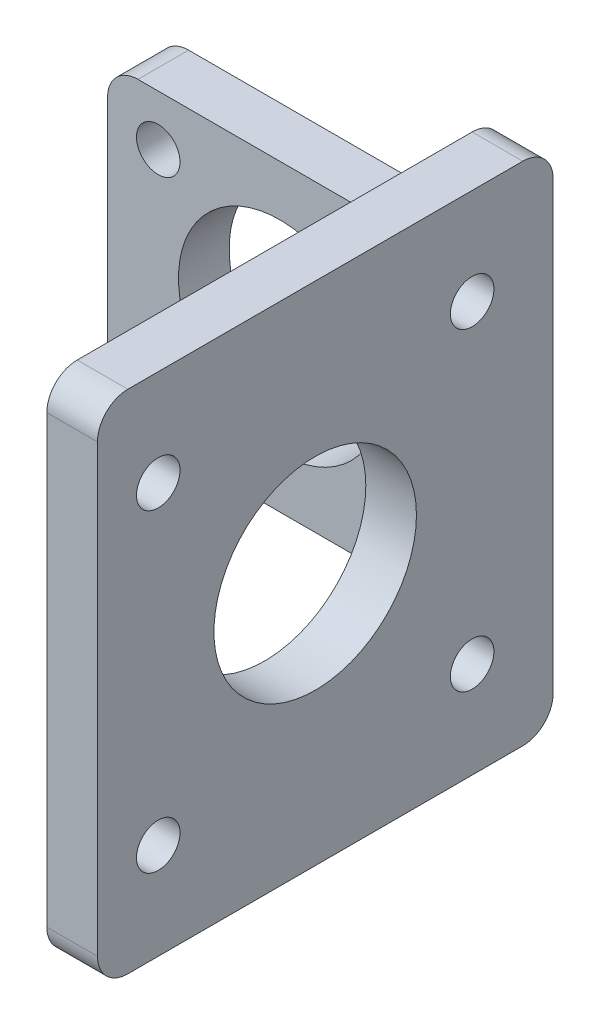
ISO-10303-21;
HEADER;
FILE_DESCRIPTION(('STEP AP214'),'2;1');
FILE_NAME('part.step','',(''),(''),'','','');
FILE_SCHEMA(('AUTOMOTIVE_DESIGN { 1 0 10303 214 1 1 1 1 }'));
ENDSEC;
DATA;
#1=APPLICATION_CONTEXT('core data for automotive mechanical design processes');
#2=APPLICATION_PROTOCOL_DEFINITION('international standard','automotive_design',2000,#1);
#3=PRODUCT_CONTEXT('',#1,'mechanical');
#4=PRODUCT('Part','Part','',(#3));
#5=PRODUCT_RELATED_PRODUCT_CATEGORY('part','',(#4));
#6=PRODUCT_DEFINITION_FORMATION('','',#4);
#7=PRODUCT_DEFINITION_CONTEXT('part definition',#1,'design');
#8=PRODUCT_DEFINITION('design','',#6,#7);
#9=PRODUCT_DEFINITION_SHAPE('','',#8);
#10=(LENGTH_UNIT() NAMED_UNIT(*) SI_UNIT(.MILLI.,.METRE.));
#11=(NAMED_UNIT(*) PLANE_ANGLE_UNIT() SI_UNIT($,.RADIAN.));
#12=(NAMED_UNIT(*) SI_UNIT($,.STERADIAN.) SOLID_ANGLE_UNIT());
#13=UNCERTAINTY_MEASURE_WITH_UNIT(LENGTH_MEASURE(1.E-05),#10,'distance_accuracy_value','');
#14=(GEOMETRIC_REPRESENTATION_CONTEXT(3) GLOBAL_UNCERTAINTY_ASSIGNED_CONTEXT((#13)) GLOBAL_UNIT_ASSIGNED_CONTEXT((#10,
#11,#12)) REPRESENTATION_CONTEXT('',''));
#15=CARTESIAN_POINT('',(0.,0.,0.));
#16=DIRECTION('',(0.,0.,1.));
#17=DIRECTION('',(1.,0.,0.));
#18=AXIS2_PLACEMENT_3D('',#15,#16,#17);
#19=CARTESIAN_POINT('',(39.,10.,45.));
#20=DIRECTION('',(-1.,0.,0.));
#21=DIRECTION('',(0.,0.,1.));
#22=AXIS2_PLACEMENT_3D('',#19,#20,#21);
#23=PLANE('',#22);
#24=CARTESIAN_POINT('',(39.,-30.5,8.));
#25=DIRECTION('',(1.,0.,0.));
#26=DIRECTION('',(0.,0.,-1.));
#27=AXIS2_PLACEMENT_3D('',#24,#25,#26);
#28=CIRCLE('',#27,2.15);
#29=CARTESIAN_POINT('',(39.,-30.5,5.85));
#30=VERTEX_POINT('',#29);
#31=EDGE_CURVE('E357',#30,#30,#28,.T.);
#32=ORIENTED_EDGE('',*,*,#31,.F.);
#33=EDGE_LOOP('',(#32));
#34=FACE_BOUND('',#33,.T.);
#35=CARTESIAN_POINT('',(39.,-15.,23.5));
#36=DIRECTION('',(1.,0.,0.));
#37=DIRECTION('',(0.,0.,-1.));
#38=AXIS2_PLACEMENT_3D('',#35,#36,#37);
#39=CIRCLE('',#38,10.);
#40=CARTESIAN_POINT('',(39.,-15.,13.5));
#41=VERTEX_POINT('',#40);
#42=EDGE_CURVE('E370',#41,#41,#39,.T.);
#43=ORIENTED_EDGE('',*,*,#42,.F.);
#44=EDGE_LOOP('',(#43));
#45=FACE_BOUND('',#44,.T.);
#46=CARTESIAN_POINT('',(39.,0.500000000000021,39.));
#47=DIRECTION('',(1.,0.,0.));
#48=DIRECTION('',(0.,0.,-1.));
#49=AXIS2_PLACEMENT_3D('',#46,#47,#48);
#50=CIRCLE('',#49,2.15);
#51=CARTESIAN_POINT('',(39.,0.500000000000021,36.85));
#52=VERTEX_POINT('',#51);
#53=EDGE_CURVE('E348',#52,#52,#50,.T.);
#54=ORIENTED_EDGE('',*,*,#53,.F.);
#55=EDGE_LOOP('',(#54));
#56=FACE_BOUND('',#55,.T.);
#57=DIRECTION('',(0.,1.,0.));
#58=VECTOR('',#57,1.);
#59=CARTESIAN_POINT('',(39.,10.,45.));
#60=LINE('',#59,#58);
#61=CARTESIAN_POINT('',(39.,-37.,45.));
#62=VERTEX_POINT('',#61);
#63=CARTESIAN_POINT('',(39.,7.00000000000001,45.));
#64=VERTEX_POINT('',#63);
#65=EDGE_CURVE('E268',#62,#64,#60,.T.);
#66=ORIENTED_EDGE('',*,*,#65,.F.);
#67=CARTESIAN_POINT('',(39.,-37.,42.));
#68=DIRECTION('',(-1.,0.,0.));
#69=DIRECTION('',(0.,0.,1.));
#70=AXIS2_PLACEMENT_3D('',#67,#68,#69);
#71=CIRCLE('',#70,3.);
#72=CARTESIAN_POINT('',(39.,-40.,42.));
#73=VERTEX_POINT('',#72);
#74=EDGE_CURVE('E232',#62,#73,#71,.F.);
#75=ORIENTED_EDGE('',*,*,#74,.T.);
#76=DIRECTION('',(0.,0.,-1.));
#77=VECTOR('',#76,1.);
#78=CARTESIAN_POINT('',(39.,-40.,45.));
#79=LINE('',#78,#77);
#80=CARTESIAN_POINT('',(39.,-40.,3.));
#81=VERTEX_POINT('',#80);
#82=EDGE_CURVE('E258',#73,#81,#79,.T.);
#83=ORIENTED_EDGE('',*,*,#82,.T.);
#84=CARTESIAN_POINT('',(39.,-37.,3.));
#85=DIRECTION('',(-1.,0.,0.));
#86=DIRECTION('',(0.,0.,1.));
#87=AXIS2_PLACEMENT_3D('',#84,#85,#86);
#88=CIRCLE('',#87,3.);
#89=CARTESIAN_POINT('',(39.,-37.,0.));
#90=VERTEX_POINT('',#89);
#91=EDGE_CURVE('E214',#81,#90,#88,.F.);
#92=ORIENTED_EDGE('',*,*,#91,.T.);
#93=DIRECTION('',(0.,-1.,0.));
#94=VECTOR('',#93,1.);
#95=CARTESIAN_POINT('',(39.,-30.,0.));
#96=LINE('',#95,#94);
#97=CARTESIAN_POINT('',(39.,7.00000000000001,0.));
#98=VERTEX_POINT('',#97);
#99=EDGE_CURVE('E285',#98,#90,#96,.T.);
#100=ORIENTED_EDGE('',*,*,#99,.F.);
#101=CARTESIAN_POINT('',(39.,7.00000000000001,3.));
#102=DIRECTION('',(-1.,0.,0.));
#103=DIRECTION('',(0.,0.,1.));
#104=AXIS2_PLACEMENT_3D('',#101,#102,#103);
#105=CIRCLE('',#104,3.);
#106=CARTESIAN_POINT('',(39.,10.,3.));
#107=VERTEX_POINT('',#106);
#108=EDGE_CURVE('E228',#98,#107,#105,.F.);
#109=ORIENTED_EDGE('',*,*,#108,.T.);
#110=DIRECTION('',(0.,0.,-1.));
#111=VECTOR('',#110,1.);
#112=CARTESIAN_POINT('',(39.,10.,45.));
#113=LINE('',#112,#111);
#114=CARTESIAN_POINT('',(39.,10.,42.));
#115=VERTEX_POINT('',#114);
#116=EDGE_CURVE('E248',#115,#107,#113,.T.);
#117=ORIENTED_EDGE('',*,*,#116,.F.);
#118=CARTESIAN_POINT('',(39.,7.00000000000001,42.));
#119=DIRECTION('',(-1.,0.,0.));
#120=DIRECTION('',(0.,0.,1.));
#121=AXIS2_PLACEMENT_3D('',#118,#119,#120);
#122=CIRCLE('',#121,3.);
#123=EDGE_CURVE('E230',#115,#64,#122,.F.);
#124=ORIENTED_EDGE('',*,*,#123,.T.);
#125=EDGE_LOOP('',(#66,#75,#83,#92,#100,#109,#117,#124));
#126=FACE_BOUND('',#125,.T.);
#127=CARTESIAN_POINT('',(39.,0.500000000000025,8.));
#128=DIRECTION('',(1.,0.,0.));
#129=DIRECTION('',(0.,0.,-1.));
#130=AXIS2_PLACEMENT_3D('',#127,#128,#129);
#131=CIRCLE('',#130,2.15);
#132=CARTESIAN_POINT('',(39.,0.500000000000025,5.85));
#133=VERTEX_POINT('',#132);
#134=EDGE_CURVE('E364',#133,#133,#131,.F.);
#135=ORIENTED_EDGE('',*,*,#134,.T.);
#136=EDGE_LOOP('',(#135));
#137=FACE_BOUND('',#136,.T.);
#138=CARTESIAN_POINT('',(39.,-30.5,39.));
#139=DIRECTION('',(1.,0.,0.));
#140=DIRECTION('',(0.,0.,-1.));
#141=AXIS2_PLACEMENT_3D('',#138,#139,#140);
#142=CIRCLE('',#141,2.15);
#143=CARTESIAN_POINT('',(39.,-30.5,36.85));
#144=VERTEX_POINT('',#143);
#145=EDGE_CURVE('E358',#144,#144,#142,.F.);
#146=ORIENTED_EDGE('',*,*,#145,.T.);
#147=EDGE_LOOP('',(#146));
#148=FACE_BOUND('',#147,.T.);
#149=ADVANCED_FACE('F37',(#34,#45,#56,#126,#137,#148),#23,.F.);
#150=CARTESIAN_POINT('',(34.,10.,45.));
#151=DIRECTION('',(1.,0.,0.));
#152=DIRECTION('',(0.,0.,-1.));
#153=AXIS2_PLACEMENT_3D('',#150,#151,#152);
#154=PLANE('',#153);
#155=CARTESIAN_POINT('',(34.,-30.5,8.));
#156=DIRECTION('',(1.,0.,0.));
#157=DIRECTION('',(0.,0.,-1.));
#158=AXIS2_PLACEMENT_3D('',#155,#156,#157);
#159=CIRCLE('',#158,2.15);
#160=CARTESIAN_POINT('',(34.,-30.5,5.85));
#161=VERTEX_POINT('',#160);
#162=EDGE_CURVE('E361',#161,#161,#159,.F.);
#163=ORIENTED_EDGE('',*,*,#162,.F.);
#164=EDGE_LOOP('',(#163));
#165=FACE_BOUND('',#164,.T.);
#166=CARTESIAN_POINT('',(34.,-15.,23.5));
#167=DIRECTION('',(1.,0.,0.));
#168=DIRECTION('',(0.,0.,-1.));
#169=AXIS2_PLACEMENT_3D('',#166,#167,#168);
#170=CIRCLE('',#169,10.);
#171=CARTESIAN_POINT('',(34.,-15.,13.5));
#172=VERTEX_POINT('',#171);
#173=EDGE_CURVE('E353',#172,#172,#170,.F.);
#174=ORIENTED_EDGE('',*,*,#173,.F.);
#175=EDGE_LOOP('',(#174));
#176=FACE_BOUND('',#175,.T.);
#177=CARTESIAN_POINT('',(34.,0.500000000000021,39.));
#178=DIRECTION('',(1.,0.,0.));
#179=DIRECTION('',(0.,0.,-1.));
#180=AXIS2_PLACEMENT_3D('',#177,#178,#179);
#181=CIRCLE('',#180,2.15);
#182=CARTESIAN_POINT('',(34.,0.500000000000021,36.85));
#183=VERTEX_POINT('',#182);
#184=EDGE_CURVE('E346',#183,#183,#181,.F.);
#185=ORIENTED_EDGE('',*,*,#184,.F.);
#186=EDGE_LOOP('',(#185));
#187=FACE_BOUND('',#186,.T.);
#188=DIRECTION('',(0.,0.,-1.));
#189=VECTOR('',#188,1.);
#190=CARTESIAN_POINT('',(34.,-40.,45.));
#191=LINE('',#190,#189);
#192=CARTESIAN_POINT('',(34.,-40.,42.));
#193=VERTEX_POINT('',#192);
#194=CARTESIAN_POINT('',(34.,-40.,3.));
#195=VERTEX_POINT('',#194);
#196=EDGE_CURVE('E283',#193,#195,#191,.T.);
#197=ORIENTED_EDGE('',*,*,#196,.F.);
#198=CARTESIAN_POINT('',(34.,-37.,42.));
#199=DIRECTION('',(1.,0.,0.));
#200=DIRECTION('',(0.,0.,-1.));
#201=AXIS2_PLACEMENT_3D('',#198,#199,#200);
#202=CIRCLE('',#201,3.);
#203=CARTESIAN_POINT('',(34.,-37.,45.));
#204=VERTEX_POINT('',#203);
#205=EDGE_CURVE('E239',#193,#204,#202,.F.);
#206=ORIENTED_EDGE('',*,*,#205,.T.);
#207=DIRECTION('',(0.,-1.,0.));
#208=VECTOR('',#207,1.);
#209=CARTESIAN_POINT('',(34.,10.,45.));
#210=LINE('',#209,#208);
#211=CARTESIAN_POINT('',(34.,7.00000000000001,45.));
#212=VERTEX_POINT('',#211);
#213=EDGE_CURVE('E266',#212,#204,#210,.T.);
#214=ORIENTED_EDGE('',*,*,#213,.F.);
#215=CARTESIAN_POINT('',(34.,7.00000000000001,42.));
#216=DIRECTION('',(1.,0.,0.));
#217=DIRECTION('',(0.,0.,-1.));
#218=AXIS2_PLACEMENT_3D('',#215,#216,#217);
#219=CIRCLE('',#218,3.);
#220=CARTESIAN_POINT('',(34.,10.,42.));
#221=VERTEX_POINT('',#220);
#222=EDGE_CURVE('E237',#212,#221,#219,.F.);
#223=ORIENTED_EDGE('',*,*,#222,.T.);
#224=DIRECTION('',(0.,0.,-1.));
#225=VECTOR('',#224,1.);
#226=CARTESIAN_POINT('',(34.,10.,45.));
#227=LINE('',#226,#225);
#228=CARTESIAN_POINT('',(34.,10.,3.));
#229=VERTEX_POINT('',#228);
#230=EDGE_CURVE('E249',#221,#229,#227,.T.);
#231=ORIENTED_EDGE('',*,*,#230,.T.);
#232=CARTESIAN_POINT('',(34.,7.00000000000001,3.));
#233=DIRECTION('',(1.,0.,0.));
#234=DIRECTION('',(0.,0.,-1.));
#235=AXIS2_PLACEMENT_3D('',#232,#233,#234);
#236=CIRCLE('',#235,3.);
#237=CARTESIAN_POINT('',(34.,7.00000000000001,0.));
#238=VERTEX_POINT('',#237);
#239=EDGE_CURVE('E52',#229,#238,#236,.F.);
#240=ORIENTED_EDGE('',*,*,#239,.T.);
#241=DIRECTION('',(0.,-1.,0.));
#242=VECTOR('',#241,1.);
#243=CARTESIAN_POINT('',(34.,0.,0.));
#244=LINE('',#243,#242);
#245=CARTESIAN_POINT('',(34.,3.,0.));
#246=VERTEX_POINT('',#245);
#247=EDGE_CURVE('E277',#238,#246,#244,.T.);
#248=ORIENTED_EDGE('',*,*,#247,.T.);
#249=DIRECTION('',(0.,0.,1.));
#250=VECTOR('',#249,1.);
#251=CARTESIAN_POINT('',(34.,3.,5.));
#252=LINE('',#251,#250);
#253=CARTESIAN_POINT('',(34.,3.,5.));
#254=VERTEX_POINT('',#253);
#255=EDGE_CURVE('E180',#246,#254,#252,.T.);
#256=ORIENTED_EDGE('',*,*,#255,.T.);
#257=DIRECTION('',(0.,-1.,0.));
#258=VECTOR('',#257,1.);
#259=CARTESIAN_POINT('',(34.,10.,5.));
#260=LINE('',#259,#258);
#261=CARTESIAN_POINT('',(34.,-33.,5.));
#262=VERTEX_POINT('',#261);
#263=EDGE_CURVE('E178',#254,#262,#260,.T.);
#264=ORIENTED_EDGE('',*,*,#263,.T.);
#265=DIRECTION('',(0.,0.,1.));
#266=VECTOR('',#265,1.);
#267=CARTESIAN_POINT('',(34.,-33.,0.));
#268=LINE('',#267,#266);
#269=CARTESIAN_POINT('',(34.,-33.,0.));
#270=VERTEX_POINT('',#269);
#271=EDGE_CURVE('E188',#262,#270,#268,.F.);
#272=ORIENTED_EDGE('',*,*,#271,.T.);
#273=DIRECTION('',(0.,-1.,0.));
#274=VECTOR('',#273,1.);
#275=CARTESIAN_POINT('',(34.,-40.,0.));
#276=LINE('',#275,#274);
#277=CARTESIAN_POINT('',(34.,-37.,0.));
#278=VERTEX_POINT('',#277);
#279=EDGE_CURVE('E273',#270,#278,#276,.T.);
#280=ORIENTED_EDGE('',*,*,#279,.T.);
#281=CARTESIAN_POINT('',(34.,-37.,3.));
#282=DIRECTION('',(1.,0.,0.));
#283=DIRECTION('',(0.,0.,-1.));
#284=AXIS2_PLACEMENT_3D('',#281,#282,#283);
#285=CIRCLE('',#284,3.);
#286=EDGE_CURVE('E219',#278,#195,#285,.F.);
#287=ORIENTED_EDGE('',*,*,#286,.T.);
#288=EDGE_LOOP('',(#197,#206,#214,#223,#231,#240,#248,#256,#264,#272,#280,#287));
#289=FACE_BOUND('',#288,.T.);
#290=CARTESIAN_POINT('',(34.,0.500000000000025,8.));
#291=DIRECTION('',(1.,0.,0.));
#292=DIRECTION('',(0.,0.,-1.));
#293=AXIS2_PLACEMENT_3D('',#290,#291,#292);
#294=CIRCLE('',#293,2.15);
#295=CARTESIAN_POINT('',(34.,0.500000000000025,5.85));
#296=VERTEX_POINT('',#295);
#297=EDGE_CURVE('E367',#296,#296,#294,.T.);
#298=ORIENTED_EDGE('',*,*,#297,.T.);
#299=EDGE_LOOP('',(#298));
#300=FACE_BOUND('',#299,.T.);
#301=CARTESIAN_POINT('',(34.,-30.5,39.));
#302=DIRECTION('',(1.,0.,0.));
#303=DIRECTION('',(0.,0.,-1.));
#304=AXIS2_PLACEMENT_3D('',#301,#302,#303);
#305=CIRCLE('',#304,2.15);
#306=CARTESIAN_POINT('',(34.,-30.5,36.85));
#307=VERTEX_POINT('',#306);
#308=EDGE_CURVE('E354',#307,#307,#305,.T.);
#309=ORIENTED_EDGE('',*,*,#308,.T.);
#310=EDGE_LOOP('',(#309));
#311=FACE_BOUND('',#310,.T.);
#312=ADVANCED_FACE('F270',(#165,#176,#187,#289,#300,#311),#154,.F.);
#313=CARTESIAN_POINT('',(34.,0.,5.));
#314=DIRECTION('',(0.,-1.,0.));
#315=DIRECTION('',(1.,0.,0.));
#316=AXIS2_PLACEMENT_3D('',#313,#314,#315);
#317=PLANE('',#316);
#318=DIRECTION('',(-1.,0.,0.));
#319=VECTOR('',#318,1.);
#320=CARTESIAN_POINT('',(34.,0.,5.));
#321=LINE('',#320,#319);
#322=CARTESIAN_POINT('',(31.,0.,5.));
#323=VERTEX_POINT('',#322);
#324=CARTESIAN_POINT('',(3.,0.,5.));
#325=VERTEX_POINT('',#324);
#326=EDGE_CURVE('E173',#323,#325,#321,.T.);
#327=ORIENTED_EDGE('',*,*,#326,.F.);
#328=DIRECTION('',(0.,0.,1.));
#329=VECTOR('',#328,1.);
#330=CARTESIAN_POINT('',(31.,0.,0.));
#331=LINE('',#330,#329);
#332=CARTESIAN_POINT('',(31.,0.,0.));
#333=VERTEX_POINT('',#332);
#334=EDGE_CURVE('E192',#323,#333,#331,.F.);
#335=ORIENTED_EDGE('',*,*,#334,.T.);
#336=DIRECTION('',(-1.,0.,0.));
#337=VECTOR('',#336,1.);
#338=CARTESIAN_POINT('',(34.,0.,0.));
#339=LINE('',#338,#337);
#340=CARTESIAN_POINT('',(3.,0.,0.));
#341=VERTEX_POINT('',#340);
#342=EDGE_CURVE('E321',#333,#341,#339,.T.);
#343=ORIENTED_EDGE('',*,*,#342,.T.);
#344=DIRECTION('',(0.,0.,-1.));
#345=VECTOR('',#344,1.);
#346=CARTESIAN_POINT('',(3.,0.,5.));
#347=LINE('',#346,#345);
#348=EDGE_CURVE('E190',#341,#325,#347,.F.);
#349=ORIENTED_EDGE('',*,*,#348,.T.);
#350=EDGE_LOOP('',(#327,#335,#343,#349));
#351=FACE_BOUND('',#350,.T.);
#352=ADVANCED_FACE('F411',(#351),#317,.F.);
#353=CARTESIAN_POINT('',(0.,-30.,5.));
#354=DIRECTION('',(0.,1.,0.));
#355=DIRECTION('',(-1.,0.,0.));
#356=AXIS2_PLACEMENT_3D('',#353,#354,#355);
#357=PLANE('',#356);
#358=DIRECTION('',(1.,0.,0.));
#359=VECTOR('',#358,1.);
#360=CARTESIAN_POINT('',(0.,-30.,0.));
#361=LINE('',#360,#359);
#362=CARTESIAN_POINT('',(3.,-30.,0.));
#363=VERTEX_POINT('',#362);
#364=CARTESIAN_POINT('',(31.,-30.,0.));
#365=VERTEX_POINT('',#364);
#366=EDGE_CURVE('E315',#363,#365,#361,.T.);
#367=ORIENTED_EDGE('',*,*,#366,.T.);
#368=DIRECTION('',(0.,0.,1.));
#369=VECTOR('',#368,1.);
#370=CARTESIAN_POINT('',(31.,-30.,5.));
#371=LINE('',#370,#369);
#372=CARTESIAN_POINT('',(31.,-30.,5.));
#373=VERTEX_POINT('',#372);
#374=EDGE_CURVE('E172',#365,#373,#371,.T.);
#375=ORIENTED_EDGE('',*,*,#374,.T.);
#376=DIRECTION('',(1.,0.,0.));
#377=VECTOR('',#376,1.);
#378=CARTESIAN_POINT('',(0.,-30.,5.));
#379=LINE('',#378,#377);
#380=CARTESIAN_POINT('',(3.,-30.,5.));
#381=VERTEX_POINT('',#380);
#382=EDGE_CURVE('E155',#381,#373,#379,.T.);
#383=ORIENTED_EDGE('',*,*,#382,.F.);
#384=DIRECTION('',(0.,0.,-1.));
#385=VECTOR('',#384,1.);
#386=CARTESIAN_POINT('',(3.,-30.,5.));
#387=LINE('',#386,#385);
#388=EDGE_CURVE('E169',#381,#363,#387,.T.);
#389=ORIENTED_EDGE('',*,*,#388,.T.);
#390=EDGE_LOOP('',(#367,#375,#383,#389));
#391=FACE_BOUND('',#390,.T.);
#392=ADVANCED_FACE('F168',(#391),#357,.F.);
#393=CARTESIAN_POINT('',(0.,0.,5.));
#394=DIRECTION('',(0.,0.,1.));
#395=DIRECTION('',(1.,0.,0.));
#396=AXIS2_PLACEMENT_3D('',#393,#394,#395);
#397=PLANE('',#396);
#398=DIRECTION('',(0.,-1.,0.));
#399=VECTOR('',#398,1.);
#400=CARTESIAN_POINT('',(0.,0.,5.));
#401=LINE('',#400,#399);
#402=CARTESIAN_POINT('',(0.,-3.,5.));
#403=VERTEX_POINT('',#402);
#404=CARTESIAN_POINT('',(0.,-27.,5.));
#405=VERTEX_POINT('',#404);
#406=EDGE_CURVE('E157',#403,#405,#401,.T.);
#407=ORIENTED_EDGE('',*,*,#406,.T.);
#408=CARTESIAN_POINT('',(3.,-27.,5.));
#409=DIRECTION('',(0.,0.,1.));
#410=DIRECTION('',(1.,0.,0.));
#411=AXIS2_PLACEMENT_3D('',#408,#409,#410);
#412=CIRCLE('',#411,3.);
#413=EDGE_CURVE('E150',#405,#381,#412,.T.);
#414=ORIENTED_EDGE('',*,*,#413,.T.);
#415=ORIENTED_EDGE('',*,*,#382,.T.);
#416=CARTESIAN_POINT('',(31.,-33.,5.));
#417=DIRECTION('',(0.,0.,1.));
#418=DIRECTION('',(1.,0.,0.));
#419=AXIS2_PLACEMENT_3D('',#416,#417,#418);
#420=CIRCLE('',#419,3.);
#421=EDGE_CURVE('E161',#373,#262,#420,.F.);
#422=ORIENTED_EDGE('',*,*,#421,.T.);
#423=ORIENTED_EDGE('',*,*,#263,.F.);
#424=CARTESIAN_POINT('',(31.,3.,5.));
#425=DIRECTION('',(0.,0.,1.));
#426=DIRECTION('',(1.,0.,0.));
#427=AXIS2_PLACEMENT_3D('',#424,#425,#426);
#428=CIRCLE('',#427,3.);
#429=EDGE_CURVE('E206',#254,#323,#428,.F.);
#430=ORIENTED_EDGE('',*,*,#429,.T.);
#431=ORIENTED_EDGE('',*,*,#326,.T.);
#432=CARTESIAN_POINT('',(3.,-3.,5.));
#433=DIRECTION('',(0.,0.,1.));
#434=DIRECTION('',(1.,0.,0.));
#435=AXIS2_PLACEMENT_3D('',#432,#433,#434);
#436=CIRCLE('',#435,3.);
#437=EDGE_CURVE('E162',#325,#403,#436,.T.);
#438=ORIENTED_EDGE('',*,*,#437,.T.);
#439=EDGE_LOOP('',(#407,#414,#415,#422,#423,#430,#431,#438));
#440=FACE_BOUND('',#439,.T.);
#441=CARTESIAN_POINT('',(29.,-25.,5.));
#442=DIRECTION('',(0.,0.,1.));
#443=DIRECTION('',(1.,0.,0.));
#444=AXIS2_PLACEMENT_3D('',#441,#442,#443);
#445=CIRCLE('',#444,2.15000000000001);
#446=CARTESIAN_POINT('',(31.15,-25.,5.));
#447=VERTEX_POINT('',#446);
#448=EDGE_CURVE('E294',#447,#447,#445,.T.);
#449=ORIENTED_EDGE('',*,*,#448,.F.);
#450=EDGE_LOOP('',(#449));
#451=FACE_BOUND('',#450,.T.);
#452=CARTESIAN_POINT('',(5.00000000000001,-25.,5.));
#453=DIRECTION('',(0.,0.,1.));
#454=DIRECTION('',(-1.,0.,0.));
#455=AXIS2_PLACEMENT_3D('',#452,#453,#454);
#456=CIRCLE('',#455,2.15);
#457=CARTESIAN_POINT('',(2.85000000000001,-25.,5.));
#458=VERTEX_POINT('',#457);
#459=EDGE_CURVE('E306',#458,#458,#456,.T.);
#460=ORIENTED_EDGE('',*,*,#459,.F.);
#461=EDGE_LOOP('',(#460));
#462=FACE_BOUND('',#461,.T.);
#463=CARTESIAN_POINT('',(29.,-5.,5.));
#464=DIRECTION('',(0.,0.,1.));
#465=DIRECTION('',(-1.,0.,0.));
#466=AXIS2_PLACEMENT_3D('',#463,#464,#465);
#467=CIRCLE('',#466,2.15);
#468=CARTESIAN_POINT('',(26.85,-5.,5.));
#469=VERTEX_POINT('',#468);
#470=EDGE_CURVE('E312',#469,#469,#467,.T.);
#471=ORIENTED_EDGE('',*,*,#470,.F.);
#472=EDGE_LOOP('',(#471));
#473=FACE_BOUND('',#472,.T.);
#474=CARTESIAN_POINT('',(5.,-5.,5.));
#475=DIRECTION('',(0.,0.,1.));
#476=DIRECTION('',(1.,0.,0.));
#477=AXIS2_PLACEMENT_3D('',#474,#475,#476);
#478=CIRCLE('',#477,2.15);
#479=CARTESIAN_POINT('',(7.15000000000001,-5.,5.));
#480=VERTEX_POINT('',#479);
#481=EDGE_CURVE('E300',#480,#480,#478,.T.);
#482=ORIENTED_EDGE('',*,*,#481,.F.);
#483=EDGE_LOOP('',(#482));
#484=FACE_BOUND('',#483,.T.);
#485=CARTESIAN_POINT('',(17.,-15.,5.));
#486=DIRECTION('',(0.,0.,1.));
#487=DIRECTION('',(1.,0.,0.));
#488=AXIS2_PLACEMENT_3D('',#485,#486,#487);
#489=CIRCLE('',#488,10.);
#490=CARTESIAN_POINT('',(27.,-15.,5.));
#491=VERTEX_POINT('',#490);
#492=EDGE_CURVE('E288',#491,#491,#489,.T.);
#493=ORIENTED_EDGE('',*,*,#492,.F.);
#494=EDGE_LOOP('',(#493));
#495=FACE_BOUND('',#494,.T.);
#496=ADVANCED_FACE('F152',(#440,#451,#462,#473,#484,#495),#397,.T.);
#497=CARTESIAN_POINT('',(0.,0.,0.));
#498=DIRECTION('',(0.,0.,1.));
#499=DIRECTION('',(1.,0.,0.));
#500=AXIS2_PLACEMENT_3D('',#497,#498,#499);
#501=PLANE('',#500);
#502=ORIENTED_EDGE('',*,*,#247,.F.);
#503=DIRECTION('',(-1.,0.,0.));
#504=VECTOR('',#503,1.);
#505=CARTESIAN_POINT('',(0.,7.00000000000001,0.));
#506=LINE('',#505,#504);
#507=EDGE_CURVE('E11',#238,#98,#506,.F.);
#508=ORIENTED_EDGE('',*,*,#507,.T.);
#509=ORIENTED_EDGE('',*,*,#99,.T.);
#510=DIRECTION('',(1.,0.,0.));
#511=VECTOR('',#510,1.);
#512=CARTESIAN_POINT('',(0.,-37.,0.));
#513=LINE('',#512,#511);
#514=EDGE_CURVE('E217',#90,#278,#513,.F.);
#515=ORIENTED_EDGE('',*,*,#514,.T.);
#516=ORIENTED_EDGE('',*,*,#279,.F.);
#517=CARTESIAN_POINT('',(31.,-33.,0.));
#518=DIRECTION('',(0.,0.,1.));
#519=DIRECTION('',(1.,0.,0.));
#520=AXIS2_PLACEMENT_3D('',#517,#518,#519);
#521=CIRCLE('',#520,3.);
#522=EDGE_CURVE('E204',#270,#365,#521,.T.);
#523=ORIENTED_EDGE('',*,*,#522,.T.);
#524=ORIENTED_EDGE('',*,*,#366,.F.);
#525=CARTESIAN_POINT('',(3.,-27.,0.));
#526=DIRECTION('',(0.,0.,1.));
#527=DIRECTION('',(1.,0.,0.));
#528=AXIS2_PLACEMENT_3D('',#525,#526,#527);
#529=CIRCLE('',#528,3.);
#530=CARTESIAN_POINT('',(0.,-27.,0.));
#531=VERTEX_POINT('',#530);
#532=EDGE_CURVE('E177',#363,#531,#529,.F.);
#533=ORIENTED_EDGE('',*,*,#532,.T.);
#534=DIRECTION('',(0.,-1.,0.));
#535=VECTOR('',#534,1.);
#536=CARTESIAN_POINT('',(0.,0.,0.));
#537=LINE('',#536,#535);
#538=CARTESIAN_POINT('',(0.,-3.,0.));
#539=VERTEX_POINT('',#538);
#540=EDGE_CURVE('E174',#539,#531,#537,.T.);
#541=ORIENTED_EDGE('',*,*,#540,.F.);
#542=CARTESIAN_POINT('',(3.,-3.,0.));
#543=DIRECTION('',(0.,0.,1.));
#544=DIRECTION('',(1.,0.,0.));
#545=AXIS2_PLACEMENT_3D('',#542,#543,#544);
#546=CIRCLE('',#545,3.);
#547=EDGE_CURVE('E194',#539,#341,#546,.F.);
#548=ORIENTED_EDGE('',*,*,#547,.T.);
#549=ORIENTED_EDGE('',*,*,#342,.F.);
#550=CARTESIAN_POINT('',(31.,3.,0.));
#551=DIRECTION('',(0.,0.,1.));
#552=DIRECTION('',(1.,0.,0.));
#553=AXIS2_PLACEMENT_3D('',#550,#551,#552);
#554=CIRCLE('',#553,3.);
#555=EDGE_CURVE('E208',#333,#246,#554,.T.);
#556=ORIENTED_EDGE('',*,*,#555,.T.);
#557=EDGE_LOOP('',(#502,#508,#509,#515,#516,#523,#524,#533,#541,#548,#549,#556));
#558=FACE_BOUND('',#557,.T.);
#559=CARTESIAN_POINT('',(29.,-5.,0.));
#560=DIRECTION('',(0.,0.,1.));
#561=DIRECTION('',(-1.,0.,0.));
#562=AXIS2_PLACEMENT_3D('',#559,#560,#561);
#563=CIRCLE('',#562,2.15);
#564=CARTESIAN_POINT('',(26.85,-5.,0.));
#565=VERTEX_POINT('',#564);
#566=EDGE_CURVE('E309',#565,#565,#563,.T.);
#567=ORIENTED_EDGE('',*,*,#566,.T.);
#568=EDGE_LOOP('',(#567));
#569=FACE_BOUND('',#568,.T.);
#570=CARTESIAN_POINT('',(5.00000000000001,-25.,0.));
#571=DIRECTION('',(0.,0.,1.));
#572=DIRECTION('',(-1.,0.,0.));
#573=AXIS2_PLACEMENT_3D('',#570,#571,#572);
#574=CIRCLE('',#573,2.15);
#575=CARTESIAN_POINT('',(2.85000000000001,-25.,0.));
#576=VERTEX_POINT('',#575);
#577=EDGE_CURVE('E303',#576,#576,#574,.T.);
#578=ORIENTED_EDGE('',*,*,#577,.T.);
#579=EDGE_LOOP('',(#578));
#580=FACE_BOUND('',#579,.T.);
#581=CARTESIAN_POINT('',(5.,-5.,0.));
#582=DIRECTION('',(0.,0.,1.));
#583=DIRECTION('',(1.,0.,0.));
#584=AXIS2_PLACEMENT_3D('',#581,#582,#583);
#585=CIRCLE('',#584,2.15);
#586=CARTESIAN_POINT('',(7.15000000000001,-5.,0.));
#587=VERTEX_POINT('',#586);
#588=EDGE_CURVE('E297',#587,#587,#585,.T.);
#589=ORIENTED_EDGE('',*,*,#588,.T.);
#590=EDGE_LOOP('',(#589));
#591=FACE_BOUND('',#590,.T.);
#592=CARTESIAN_POINT('',(29.,-25.,0.));
#593=DIRECTION('',(0.,0.,1.));
#594=DIRECTION('',(1.,0.,0.));
#595=AXIS2_PLACEMENT_3D('',#592,#593,#594);
#596=CIRCLE('',#595,2.15000000000001);
#597=CARTESIAN_POINT('',(31.15,-25.,0.));
#598=VERTEX_POINT('',#597);
#599=EDGE_CURVE('E291',#598,#598,#596,.T.);
#600=ORIENTED_EDGE('',*,*,#599,.T.);
#601=EDGE_LOOP('',(#600));
#602=FACE_BOUND('',#601,.T.);
#603=CARTESIAN_POINT('',(17.,-15.,0.));
#604=DIRECTION('',(0.,0.,1.));
#605=DIRECTION('',(1.,0.,0.));
#606=AXIS2_PLACEMENT_3D('',#603,#604,#605);
#607=CIRCLE('',#606,10.);
#608=CARTESIAN_POINT('',(27.,-15.,0.));
#609=VERTEX_POINT('',#608);
#610=EDGE_CURVE('E287',#609,#609,#607,.T.);
#611=ORIENTED_EDGE('',*,*,#610,.T.);
#612=EDGE_LOOP('',(#611));
#613=FACE_BOUND('',#612,.T.);
#614=ADVANCED_FACE('F332',(#558,#569,#580,#591,#602,#613),#501,.F.);
#615=CARTESIAN_POINT('',(0.,0.,5.));
#616=DIRECTION('',(1.,0.,0.));
#617=DIRECTION('',(0.,1.,0.));
#618=AXIS2_PLACEMENT_3D('',#615,#616,#617);
#619=PLANE('',#618);
#620=ORIENTED_EDGE('',*,*,#540,.T.);
#621=DIRECTION('',(0.,0.,-1.));
#622=VECTOR('',#621,1.);
#623=CARTESIAN_POINT('',(0.,-27.,5.));
#624=LINE('',#623,#622);
#625=EDGE_CURVE('E200',#531,#405,#624,.F.);
#626=ORIENTED_EDGE('',*,*,#625,.T.);
#627=ORIENTED_EDGE('',*,*,#406,.F.);
#628=DIRECTION('',(0.,0.,-1.));
#629=VECTOR('',#628,1.);
#630=CARTESIAN_POINT('',(0.,-3.,5.));
#631=LINE('',#630,#629);
#632=EDGE_CURVE('E197',#403,#539,#631,.T.);
#633=ORIENTED_EDGE('',*,*,#632,.T.);
#634=EDGE_LOOP('',(#620,#626,#627,#633));
#635=FACE_BOUND('',#634,.T.);
#636=ADVANCED_FACE('F329',(#635),#619,.F.);
#637=CARTESIAN_POINT('',(29.,-5.,5.));
#638=DIRECTION('',(0.,0.,-1.));
#639=DIRECTION('',(-1.,0.,0.));
#640=AXIS2_PLACEMENT_3D('',#637,#638,#639);
#641=CYLINDRICAL_SURFACE('',#640,2.15);
#642=ORIENTED_EDGE('',*,*,#470,.T.);
#643=EDGE_LOOP('',(#642));
#644=FACE_BOUND('',#643,.T.);
#645=ORIENTED_EDGE('',*,*,#566,.F.);
#646=EDGE_LOOP('',(#645));
#647=FACE_BOUND('',#646,.T.);
#648=ADVANCED_FACE('F428',(#644,#647),#641,.F.);
#649=CARTESIAN_POINT('',(5.00000000000001,-25.,5.));
#650=DIRECTION('',(0.,0.,-1.));
#651=DIRECTION('',(-1.,0.,0.));
#652=AXIS2_PLACEMENT_3D('',#649,#650,#651);
#653=CYLINDRICAL_SURFACE('',#652,2.15);
#654=ORIENTED_EDGE('',*,*,#459,.T.);
#655=EDGE_LOOP('',(#654));
#656=FACE_BOUND('',#655,.T.);
#657=ORIENTED_EDGE('',*,*,#577,.F.);
#658=EDGE_LOOP('',(#657));
#659=FACE_BOUND('',#658,.T.);
#660=ADVANCED_FACE('F424',(#656,#659),#653,.F.);
#661=CARTESIAN_POINT('',(5.,-5.,5.));
#662=DIRECTION('',(0.,0.,-1.));
#663=DIRECTION('',(-1.,0.,0.));
#664=AXIS2_PLACEMENT_3D('',#661,#662,#663);
#665=CYLINDRICAL_SURFACE('',#664,2.15);
#666=ORIENTED_EDGE('',*,*,#481,.T.);
#667=EDGE_LOOP('',(#666));
#668=FACE_BOUND('',#667,.T.);
#669=ORIENTED_EDGE('',*,*,#588,.F.);
#670=EDGE_LOOP('',(#669));
#671=FACE_BOUND('',#670,.T.);
#672=ADVANCED_FACE('F420',(#668,#671),#665,.F.);
#673=CARTESIAN_POINT('',(29.,-25.,5.));
#674=DIRECTION('',(0.,0.,-1.));
#675=DIRECTION('',(-1.,0.,0.));
#676=AXIS2_PLACEMENT_3D('',#673,#674,#675);
#677=CYLINDRICAL_SURFACE('',#676,2.15000000000001);
#678=ORIENTED_EDGE('',*,*,#448,.T.);
#679=EDGE_LOOP('',(#678));
#680=FACE_BOUND('',#679,.T.);
#681=ORIENTED_EDGE('',*,*,#599,.F.);
#682=EDGE_LOOP('',(#681));
#683=FACE_BOUND('',#682,.T.);
#684=ADVANCED_FACE('F416',(#680,#683),#677,.F.);
#685=CARTESIAN_POINT('',(17.,-15.,5.));
#686=DIRECTION('',(0.,0.,-1.));
#687=DIRECTION('',(-1.,0.,0.));
#688=AXIS2_PLACEMENT_3D('',#685,#686,#687);
#689=CYLINDRICAL_SURFACE('',#688,10.);
#690=ORIENTED_EDGE('',*,*,#492,.T.);
#691=EDGE_LOOP('',(#690));
#692=FACE_BOUND('',#691,.T.);
#693=ORIENTED_EDGE('',*,*,#610,.F.);
#694=EDGE_LOOP('',(#693));
#695=FACE_BOUND('',#694,.T.);
#696=ADVANCED_FACE('F408',(#692,#695),#689,.F.);
#697=CARTESIAN_POINT('',(34.,-40.,45.));
#698=DIRECTION('',(0.,1.,0.));
#699=DIRECTION('',(0.,0.,1.));
#700=AXIS2_PLACEMENT_3D('',#697,#698,#699);
#701=PLANE('',#700);
#702=ORIENTED_EDGE('',*,*,#82,.F.);
#703=DIRECTION('',(1.,0.,0.));
#704=VECTOR('',#703,1.);
#705=CARTESIAN_POINT('',(34.,-40.,42.));
#706=LINE('',#705,#704);
#707=EDGE_CURVE('E234',#73,#193,#706,.F.);
#708=ORIENTED_EDGE('',*,*,#707,.T.);
#709=ORIENTED_EDGE('',*,*,#196,.T.);
#710=DIRECTION('',(1.,0.,0.));
#711=VECTOR('',#710,1.);
#712=CARTESIAN_POINT('',(34.,-40.,3.));
#713=LINE('',#712,#711);
#714=EDGE_CURVE('E211',#195,#81,#713,.T.);
#715=ORIENTED_EDGE('',*,*,#714,.T.);
#716=EDGE_LOOP('',(#702,#708,#709,#715));
#717=FACE_BOUND('',#716,.T.);
#718=ADVANCED_FACE('F405',(#717),#701,.F.);
#719=CARTESIAN_POINT('',(34.,10.,45.));
#720=DIRECTION('',(0.,-1.,0.));
#721=DIRECTION('',(0.,0.,-1.));
#722=AXIS2_PLACEMENT_3D('',#719,#720,#721);
#723=PLANE('',#722);
#724=ORIENTED_EDGE('',*,*,#230,.F.);
#725=DIRECTION('',(-1.,0.,0.));
#726=VECTOR('',#725,1.);
#727=CARTESIAN_POINT('',(39.,10.,42.));
#728=LINE('',#727,#726);
#729=EDGE_CURVE('E45',#221,#115,#728,.F.);
#730=ORIENTED_EDGE('',*,*,#729,.T.);
#731=ORIENTED_EDGE('',*,*,#116,.T.);
#732=DIRECTION('',(-1.,0.,0.));
#733=VECTOR('',#732,1.);
#734=CARTESIAN_POINT('',(34.,10.,3.));
#735=LINE('',#734,#733);
#736=EDGE_CURVE('E241',#107,#229,#735,.T.);
#737=ORIENTED_EDGE('',*,*,#736,.T.);
#738=EDGE_LOOP('',(#724,#730,#731,#737));
#739=FACE_BOUND('',#738,.T.);
#740=ADVANCED_FACE('F247',(#739),#723,.F.);
#741=CARTESIAN_POINT('',(0.,0.,45.));
#742=DIRECTION('',(0.,0.,1.));
#743=DIRECTION('',(1.,0.,0.));
#744=AXIS2_PLACEMENT_3D('',#741,#742,#743);
#745=PLANE('',#744);
#746=ORIENTED_EDGE('',*,*,#213,.T.);
#747=DIRECTION('',(1.,0.,0.));
#748=VECTOR('',#747,1.);
#749=CARTESIAN_POINT('',(39.,-37.,45.));
#750=LINE('',#749,#748);
#751=EDGE_CURVE('E225',#204,#62,#750,.T.);
#752=ORIENTED_EDGE('',*,*,#751,.T.);
#753=ORIENTED_EDGE('',*,*,#65,.T.);
#754=DIRECTION('',(-1.,0.,0.));
#755=VECTOR('',#754,1.);
#756=CARTESIAN_POINT('',(34.,7.00000000000001,45.));
#757=LINE('',#756,#755);
#758=EDGE_CURVE('E222',#64,#212,#757,.T.);
#759=ORIENTED_EDGE('',*,*,#758,.T.);
#760=EDGE_LOOP('',(#746,#752,#753,#759));
#761=FACE_BOUND('',#760,.T.);
#762=ADVANCED_FACE('F265',(#761),#745,.T.);
#763=CARTESIAN_POINT('',(31.,-33.,5.));
#764=DIRECTION('',(0.,0.,-1.));
#765=DIRECTION('',(-1.,0.,0.));
#766=AXIS2_PLACEMENT_3D('',#763,#764,#765);
#767=CYLINDRICAL_SURFACE('',#766,3.);
#768=ORIENTED_EDGE('',*,*,#522,.F.);
#769=ORIENTED_EDGE('',*,*,#271,.F.);
#770=ORIENTED_EDGE('',*,*,#421,.F.);
#771=ORIENTED_EDGE('',*,*,#374,.F.);
#772=EDGE_LOOP('',(#768,#769,#770,#771));
#773=FACE_BOUND('',#772,.T.);
#774=ADVANCED_FACE('F337',(#773),#767,.F.);
#775=CARTESIAN_POINT('',(31.,3.,45.));
#776=DIRECTION('',(0.,0.,-1.));
#777=DIRECTION('',(-1.,0.,0.));
#778=AXIS2_PLACEMENT_3D('',#775,#776,#777);
#779=CYLINDRICAL_SURFACE('',#778,3.);
#780=ORIENTED_EDGE('',*,*,#555,.F.);
#781=ORIENTED_EDGE('',*,*,#334,.F.);
#782=ORIENTED_EDGE('',*,*,#429,.F.);
#783=ORIENTED_EDGE('',*,*,#255,.F.);
#784=EDGE_LOOP('',(#780,#781,#782,#783));
#785=FACE_BOUND('',#784,.T.);
#786=ADVANCED_FACE('F345',(#785),#779,.F.);
#787=CARTESIAN_POINT('',(3.,-27.,5.));
#788=DIRECTION('',(0.,0.,-1.));
#789=DIRECTION('',(-1.,0.,0.));
#790=AXIS2_PLACEMENT_3D('',#787,#788,#789);
#791=CYLINDRICAL_SURFACE('',#790,3.);
#792=ORIENTED_EDGE('',*,*,#413,.F.);
#793=ORIENTED_EDGE('',*,*,#625,.F.);
#794=ORIENTED_EDGE('',*,*,#532,.F.);
#795=ORIENTED_EDGE('',*,*,#388,.F.);
#796=EDGE_LOOP('',(#792,#793,#794,#795));
#797=FACE_BOUND('',#796,.T.);
#798=ADVANCED_FACE('F176',(#797),#791,.T.);
#799=CARTESIAN_POINT('',(3.,-3.,5.));
#800=DIRECTION('',(0.,0.,-1.));
#801=DIRECTION('',(-1.,0.,0.));
#802=AXIS2_PLACEMENT_3D('',#799,#800,#801);
#803=CYLINDRICAL_SURFACE('',#802,3.);
#804=ORIENTED_EDGE('',*,*,#437,.F.);
#805=ORIENTED_EDGE('',*,*,#348,.F.);
#806=ORIENTED_EDGE('',*,*,#547,.F.);
#807=ORIENTED_EDGE('',*,*,#632,.F.);
#808=EDGE_LOOP('',(#804,#805,#806,#807));
#809=FACE_BOUND('',#808,.T.);
#810=ADVANCED_FACE('F449',(#809),#803,.T.);
#811=CARTESIAN_POINT('',(34.,-37.,3.));
#812=DIRECTION('',(1.,0.,0.));
#813=DIRECTION('',(0.,0.,-1.));
#814=AXIS2_PLACEMENT_3D('',#811,#812,#813);
#815=CYLINDRICAL_SURFACE('',#814,3.);
#816=ORIENTED_EDGE('',*,*,#286,.F.);
#817=ORIENTED_EDGE('',*,*,#514,.F.);
#818=ORIENTED_EDGE('',*,*,#91,.F.);
#819=ORIENTED_EDGE('',*,*,#714,.F.);
#820=EDGE_LOOP('',(#816,#817,#818,#819));
#821=FACE_BOUND('',#820,.T.);
#822=ADVANCED_FACE('F452',(#821),#815,.T.);
#823=CARTESIAN_POINT('',(0.,-37.,42.));
#824=DIRECTION('',(-1.,0.,0.));
#825=DIRECTION('',(0.,0.,1.));
#826=AXIS2_PLACEMENT_3D('',#823,#824,#825);
#827=CYLINDRICAL_SURFACE('',#826,3.);
#828=ORIENTED_EDGE('',*,*,#205,.F.);
#829=ORIENTED_EDGE('',*,*,#707,.F.);
#830=ORIENTED_EDGE('',*,*,#74,.F.);
#831=ORIENTED_EDGE('',*,*,#751,.F.);
#832=EDGE_LOOP('',(#828,#829,#830,#831));
#833=FACE_BOUND('',#832,.T.);
#834=ADVANCED_FACE('F456',(#833),#827,.T.);
#835=CARTESIAN_POINT('',(0.,7.00000000000001,42.));
#836=DIRECTION('',(1.,0.,0.));
#837=DIRECTION('',(0.,0.,-1.));
#838=AXIS2_PLACEMENT_3D('',#835,#836,#837);
#839=CYLINDRICAL_SURFACE('',#838,3.);
#840=ORIENTED_EDGE('',*,*,#123,.F.);
#841=ORIENTED_EDGE('',*,*,#729,.F.);
#842=ORIENTED_EDGE('',*,*,#222,.F.);
#843=ORIENTED_EDGE('',*,*,#758,.F.);
#844=EDGE_LOOP('',(#840,#841,#842,#843));
#845=FACE_BOUND('',#844,.T.);
#846=ADVANCED_FACE('F261',(#845),#839,.T.);
#847=CARTESIAN_POINT('',(34.,7.00000000000001,3.));
#848=DIRECTION('',(-1.,0.,0.));
#849=DIRECTION('',(0.,0.,1.));
#850=AXIS2_PLACEMENT_3D('',#847,#848,#849);
#851=CYLINDRICAL_SURFACE('',#850,3.);
#852=ORIENTED_EDGE('',*,*,#108,.F.);
#853=ORIENTED_EDGE('',*,*,#507,.F.);
#854=ORIENTED_EDGE('',*,*,#239,.F.);
#855=ORIENTED_EDGE('',*,*,#736,.F.);
#856=EDGE_LOOP('',(#852,#853,#854,#855));
#857=FACE_BOUND('',#856,.T.);
#858=ADVANCED_FACE('F39',(#857),#851,.T.);
#859=CARTESIAN_POINT('',(5.7157287525381,0.500000000000021,39.));
#860=DIRECTION('',(1.,0.,0.));
#861=DIRECTION('',(0.,0.,-1.));
#862=AXIS2_PLACEMENT_3D('',#859,#860,#861);
#863=CYLINDRICAL_SURFACE('',#862,2.15);
#864=ORIENTED_EDGE('',*,*,#184,.T.);
#865=EDGE_LOOP('',(#864));
#866=FACE_BOUND('',#865,.T.);
#867=ORIENTED_EDGE('',*,*,#53,.T.);
#868=EDGE_LOOP('',(#867));
#869=FACE_BOUND('',#868,.T.);
#870=ADVANCED_FACE('F386',(#866,#869),#863,.F.);
#871=CARTESIAN_POINT('',(5.7157287525381,-15.,23.5));
#872=DIRECTION('',(1.,0.,0.));
#873=DIRECTION('',(0.,0.,-1.));
#874=AXIS2_PLACEMENT_3D('',#871,#872,#873);
#875=CYLINDRICAL_SURFACE('',#874,10.);
#876=ORIENTED_EDGE('',*,*,#173,.T.);
#877=EDGE_LOOP('',(#876));
#878=FACE_BOUND('',#877,.T.);
#879=ORIENTED_EDGE('',*,*,#42,.T.);
#880=EDGE_LOOP('',(#879));
#881=FACE_BOUND('',#880,.T.);
#882=ADVANCED_FACE('F378',(#878,#881),#875,.F.);
#883=CARTESIAN_POINT('',(5.7157287525381,0.500000000000025,8.));
#884=DIRECTION('',(1.,0.,0.));
#885=DIRECTION('',(0.,0.,-1.));
#886=AXIS2_PLACEMENT_3D('',#883,#884,#885);
#887=CYLINDRICAL_SURFACE('',#886,2.15);
#888=ORIENTED_EDGE('',*,*,#297,.F.);
#889=EDGE_LOOP('',(#888));
#890=FACE_BOUND('',#889,.T.);
#891=ORIENTED_EDGE('',*,*,#134,.F.);
#892=EDGE_LOOP('',(#891));
#893=FACE_BOUND('',#892,.T.);
#894=ADVANCED_FACE('F394',(#890,#893),#887,.F.);
#895=CARTESIAN_POINT('',(5.7157287525381,-30.5,8.));
#896=DIRECTION('',(1.,0.,0.));
#897=DIRECTION('',(0.,0.,-1.));
#898=AXIS2_PLACEMENT_3D('',#895,#896,#897);
#899=CYLINDRICAL_SURFACE('',#898,2.15);
#900=ORIENTED_EDGE('',*,*,#162,.T.);
#901=EDGE_LOOP('',(#900));
#902=FACE_BOUND('',#901,.T.);
#903=ORIENTED_EDGE('',*,*,#31,.T.);
#904=EDGE_LOOP('',(#903));
#905=FACE_BOUND('',#904,.T.);
#906=ADVANCED_FACE('F506',(#902,#905),#899,.F.);
#907=CARTESIAN_POINT('',(5.7157287525381,-30.5,39.));
#908=DIRECTION('',(1.,0.,0.));
#909=DIRECTION('',(0.,0.,-1.));
#910=AXIS2_PLACEMENT_3D('',#907,#908,#909);
#911=CYLINDRICAL_SURFACE('',#910,2.15);
#912=ORIENTED_EDGE('',*,*,#308,.F.);
#913=EDGE_LOOP('',(#912));
#914=FACE_BOUND('',#913,.T.);
#915=ORIENTED_EDGE('',*,*,#145,.F.);
#916=EDGE_LOOP('',(#915));
#917=FACE_BOUND('',#916,.T.);
#918=ADVANCED_FACE('F399',(#914,#917),#911,.F.);
#919=CLOSED_SHELL('',(#149,#312,#352,#392,#496,#614,#636,#648,#660,#672,#684,#696,#718,#740,
#762,#774,#786,#798,#810,#822,#834,#846,#858,#870,#882,#894,#906,#918));
#920=MANIFOLD_SOLID_BREP('B2',#919);
#921=ADVANCED_BREP_SHAPE_REPRESENTATION('',(#18,#920),#14);
#922=SHAPE_DEFINITION_REPRESENTATION(#9,#921);
ENDSEC;
END-ISO-10303-21;
